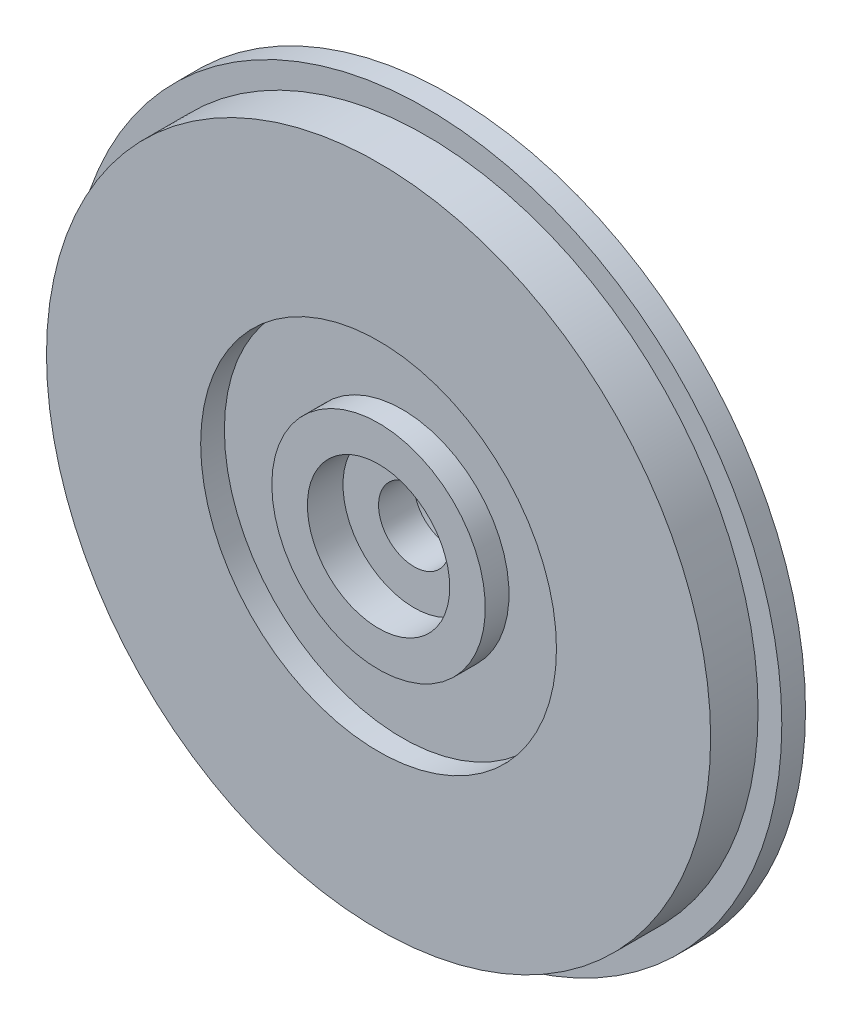
ISO-10303-21;
HEADER;
FILE_DESCRIPTION(('STEP AP214'),'2;1');
FILE_NAME('part.step','',(''),(''),'','','');
FILE_SCHEMA(('AUTOMOTIVE_DESIGN { 1 0 10303 214 1 1 1 1 }'));
ENDSEC;
DATA;
#1=APPLICATION_CONTEXT('core data for automotive mechanical design processes');
#2=APPLICATION_PROTOCOL_DEFINITION('international standard','automotive_design',2000,#1);
#3=PRODUCT_CONTEXT('',#1,'mechanical');
#4=PRODUCT('Part','Part','',(#3));
#5=PRODUCT_RELATED_PRODUCT_CATEGORY('part','',(#4));
#6=PRODUCT_DEFINITION_FORMATION('','',#4);
#7=PRODUCT_DEFINITION_CONTEXT('part definition',#1,'design');
#8=PRODUCT_DEFINITION('design','',#6,#7);
#9=PRODUCT_DEFINITION_SHAPE('','',#8);
#10=(LENGTH_UNIT() NAMED_UNIT(*) SI_UNIT(.MILLI.,.METRE.));
#11=(NAMED_UNIT(*) PLANE_ANGLE_UNIT() SI_UNIT($,.RADIAN.));
#12=(NAMED_UNIT(*) SI_UNIT($,.STERADIAN.) SOLID_ANGLE_UNIT());
#13=UNCERTAINTY_MEASURE_WITH_UNIT(LENGTH_MEASURE(1.E-05),#10,'distance_accuracy_value','');
#14=(GEOMETRIC_REPRESENTATION_CONTEXT(3) GLOBAL_UNCERTAINTY_ASSIGNED_CONTEXT((#13)) GLOBAL_UNIT_ASSIGNED_CONTEXT((#10,
#11,#12)) REPRESENTATION_CONTEXT('',''));
#15=CARTESIAN_POINT('',(0.,0.,0.));
#16=DIRECTION('',(0.,0.,1.));
#17=DIRECTION('',(1.,0.,0.));
#18=AXIS2_PLACEMENT_3D('',#15,#16,#17);
#19=CARTESIAN_POINT('',(15.,0.,-2.));
#20=DIRECTION('',(0.,0.,1.));
#21=DIRECTION('',(1.,0.,0.));
#22=AXIS2_PLACEMENT_3D('',#19,#20,#21);
#23=PLANE('',#22);
#24=CARTESIAN_POINT('',(0.,0.,-2.00000000000001));
#25=DIRECTION('',(0.,0.,1.));
#26=DIRECTION('',(1.,0.,0.));
#27=AXIS2_PLACEMENT_3D('',#24,#25,#26);
#28=CIRCLE('',#27,1.5);
#29=CARTESIAN_POINT('',(1.5,0.,-2.00000000000001));
#30=VERTEX_POINT('',#29);
#31=EDGE_CURVE('E92',#30,#30,#28,.T.);
#32=ORIENTED_EDGE('',*,*,#31,.T.);
#33=EDGE_LOOP('',(#32));
#34=FACE_BOUND('',#33,.T.);
#35=CARTESIAN_POINT('',(0.,0.,-2.));
#36=DIRECTION('',(0.,0.,-1.));
#37=DIRECTION('',(-1.,0.,0.));
#38=AXIS2_PLACEMENT_3D('',#35,#36,#37);
#39=CIRCLE('',#38,4.);
#40=CARTESIAN_POINT('',(-4.,0.,-2.));
#41=VERTEX_POINT('',#40);
#42=EDGE_CURVE('E108',#41,#41,#39,.T.);
#43=ORIENTED_EDGE('',*,*,#42,.T.);
#44=EDGE_LOOP('',(#43));
#45=FACE_BOUND('',#44,.T.);
#46=ADVANCED_FACE('F43',(#34,#45),#23,.F.);
#47=CARTESIAN_POINT('',(0.,0.,1.));
#48=DIRECTION('',(0.,0.,-1.));
#49=DIRECTION('',(-1.,0.,0.));
#50=AXIS2_PLACEMENT_3D('',#47,#48,#49);
#51=PLANE('',#50);
#52=CARTESIAN_POINT('',(0.,0.,1.));
#53=DIRECTION('',(0.,0.,1.));
#54=DIRECTION('',(1.,0.,0.));
#55=AXIS2_PLACEMENT_3D('',#52,#53,#54);
#56=CIRCLE('',#55,3.);
#57=CARTESIAN_POINT('',(3.,0.,1.));
#58=VERTEX_POINT('',#57);
#59=EDGE_CURVE('E88',#58,#58,#56,.T.);
#60=ORIENTED_EDGE('',*,*,#59,.F.);
#61=EDGE_LOOP('',(#60));
#62=FACE_BOUND('',#61,.T.);
#63=CARTESIAN_POINT('',(0.,0.,1.));
#64=DIRECTION('',(0.,0.,-1.));
#65=DIRECTION('',(-1.,0.,0.));
#66=AXIS2_PLACEMENT_3D('',#63,#64,#65);
#67=CIRCLE('',#66,4.5);
#68=CARTESIAN_POINT('',(-4.5,0.,0.999999999999999));
#69=VERTEX_POINT('',#68);
#70=EDGE_CURVE('E51',#69,#69,#67,.T.);
#71=ORIENTED_EDGE('',*,*,#70,.F.);
#72=EDGE_LOOP('',(#71));
#73=FACE_BOUND('',#72,.T.);
#74=ADVANCED_FACE('F45',(#62,#73),#51,.F.);
#75=CARTESIAN_POINT('',(0.,0.,-2.));
#76=DIRECTION('',(0.,0.,-1.));
#77=DIRECTION('',(-1.,0.,0.));
#78=AXIS2_PLACEMENT_3D('',#75,#76,#77);
#79=CYLINDRICAL_SURFACE('',#78,4.5);
#80=CARTESIAN_POINT('',(0.,0.,0.));
#81=DIRECTION('',(0.,0.,-1.));
#82=DIRECTION('',(-1.,0.,0.));
#83=AXIS2_PLACEMENT_3D('',#80,#81,#82);
#84=CIRCLE('',#83,4.5);
#85=CARTESIAN_POINT('',(-4.5,0.,0.));
#86=VERTEX_POINT('',#85);
#87=EDGE_CURVE('E56',#86,#86,#84,.T.);
#88=ORIENTED_EDGE('',*,*,#87,.F.);
#89=EDGE_LOOP('',(#88));
#90=FACE_BOUND('',#89,.T.);
#91=ORIENTED_EDGE('',*,*,#70,.T.);
#92=EDGE_LOOP('',(#91));
#93=FACE_BOUND('',#92,.T.);
#94=ADVANCED_FACE('F145',(#90,#93),#79,.T.);
#95=CARTESIAN_POINT('',(4.5,0.,0.));
#96=DIRECTION('',(0.,0.,-1.));
#97=DIRECTION('',(-1.,0.,0.));
#98=AXIS2_PLACEMENT_3D('',#95,#96,#97);
#99=PLANE('',#98);
#100=CARTESIAN_POINT('',(0.,0.,0.));
#101=DIRECTION('',(0.,0.,-1.));
#102=DIRECTION('',(-1.,0.,0.));
#103=AXIS2_PLACEMENT_3D('',#100,#101,#102);
#104=CIRCLE('',#103,7.5);
#105=CARTESIAN_POINT('',(-7.5,0.,0.));
#106=VERTEX_POINT('',#105);
#107=EDGE_CURVE('E61',#106,#106,#104,.T.);
#108=ORIENTED_EDGE('',*,*,#107,.F.);
#109=EDGE_LOOP('',(#108));
#110=FACE_BOUND('',#109,.T.);
#111=ORIENTED_EDGE('',*,*,#87,.T.);
#112=EDGE_LOOP('',(#111));
#113=FACE_BOUND('',#112,.T.);
#114=ADVANCED_FACE('F185',(#110,#113),#99,.F.);
#115=CARTESIAN_POINT('',(0.,0.,-2.));
#116=DIRECTION('',(0.,0.,-1.));
#117=DIRECTION('',(-1.,0.,0.));
#118=AXIS2_PLACEMENT_3D('',#115,#116,#117);
#119=CYLINDRICAL_SURFACE('',#118,7.5);
#120=CARTESIAN_POINT('',(0.,0.,0.999999999999999));
#121=DIRECTION('',(0.,0.,-1.));
#122=DIRECTION('',(-1.,0.,0.));
#123=AXIS2_PLACEMENT_3D('',#120,#121,#122);
#124=CIRCLE('',#123,7.5);
#125=CARTESIAN_POINT('',(-7.5,0.,0.999999999999998));
#126=VERTEX_POINT('',#125);
#127=EDGE_CURVE('E67',#126,#126,#124,.T.);
#128=ORIENTED_EDGE('',*,*,#127,.F.);
#129=EDGE_LOOP('',(#128));
#130=FACE_BOUND('',#129,.T.);
#131=ORIENTED_EDGE('',*,*,#107,.T.);
#132=EDGE_LOOP('',(#131));
#133=FACE_BOUND('',#132,.T.);
#134=ADVANCED_FACE('F179',(#130,#133),#119,.F.);
#135=CARTESIAN_POINT('',(7.5,0.,1.));
#136=DIRECTION('',(0.,0.,-1.));
#137=DIRECTION('',(-1.,0.,0.));
#138=AXIS2_PLACEMENT_3D('',#135,#136,#137);
#139=PLANE('',#138);
#140=CARTESIAN_POINT('',(0.,0.,0.999999999999998));
#141=DIRECTION('',(0.,0.,-1.));
#142=DIRECTION('',(-1.,0.,0.));
#143=AXIS2_PLACEMENT_3D('',#140,#141,#142);
#144=CIRCLE('',#143,14.);
#145=CARTESIAN_POINT('',(-14.,0.,0.999999999999996));
#146=VERTEX_POINT('',#145);
#147=EDGE_CURVE('E71',#146,#146,#144,.T.);
#148=ORIENTED_EDGE('',*,*,#147,.F.);
#149=EDGE_LOOP('',(#148));
#150=FACE_BOUND('',#149,.T.);
#151=ORIENTED_EDGE('',*,*,#127,.T.);
#152=EDGE_LOOP('',(#151));
#153=FACE_BOUND('',#152,.T.);
#154=ADVANCED_FACE('F173',(#150,#153),#139,.F.);
#155=CARTESIAN_POINT('',(0.,0.,-2.));
#156=DIRECTION('',(0.,0.,-1.));
#157=DIRECTION('',(-1.,0.,0.));
#158=AXIS2_PLACEMENT_3D('',#155,#156,#157);
#159=CYLINDRICAL_SURFACE('',#158,14.);
#160=CARTESIAN_POINT('',(0.,0.,-1.));
#161=DIRECTION('',(0.,0.,-1.));
#162=DIRECTION('',(-1.,0.,0.));
#163=AXIS2_PLACEMENT_3D('',#160,#161,#162);
#164=CIRCLE('',#163,14.);
#165=CARTESIAN_POINT('',(-14.,0.,-1.00000000000001));
#166=VERTEX_POINT('',#165);
#167=EDGE_CURVE('E75',#166,#166,#164,.T.);
#168=ORIENTED_EDGE('',*,*,#167,.F.);
#169=EDGE_LOOP('',(#168));
#170=FACE_BOUND('',#169,.T.);
#171=ORIENTED_EDGE('',*,*,#147,.T.);
#172=EDGE_LOOP('',(#171));
#173=FACE_BOUND('',#172,.T.);
#174=ADVANCED_FACE('F167',(#170,#173),#159,.T.);
#175=CARTESIAN_POINT('',(14.,0.,-1.));
#176=DIRECTION('',(0.,0.,-1.));
#177=DIRECTION('',(-1.,0.,0.));
#178=AXIS2_PLACEMENT_3D('',#175,#176,#177);
#179=PLANE('',#178);
#180=CARTESIAN_POINT('',(0.,0.,-1.));
#181=DIRECTION('',(0.,0.,-1.));
#182=DIRECTION('',(-1.,0.,0.));
#183=AXIS2_PLACEMENT_3D('',#180,#181,#182);
#184=CIRCLE('',#183,15.);
#185=CARTESIAN_POINT('',(-15.,0.,-1.00000000000001));
#186=VERTEX_POINT('',#185);
#187=EDGE_CURVE('E79',#186,#186,#184,.T.);
#188=ORIENTED_EDGE('',*,*,#187,.F.);
#189=EDGE_LOOP('',(#188));
#190=FACE_BOUND('',#189,.T.);
#191=ORIENTED_EDGE('',*,*,#167,.T.);
#192=EDGE_LOOP('',(#191));
#193=FACE_BOUND('',#192,.T.);
#194=ADVANCED_FACE('F158',(#190,#193),#179,.F.);
#195=CARTESIAN_POINT('',(0.,0.,-2.));
#196=DIRECTION('',(0.,0.,-1.));
#197=DIRECTION('',(-1.,0.,0.));
#198=AXIS2_PLACEMENT_3D('',#195,#196,#197);
#199=CYLINDRICAL_SURFACE('',#198,15.);
#200=CARTESIAN_POINT('',(0.,0.,-2.));
#201=DIRECTION('',(0.,0.,-1.));
#202=DIRECTION('',(-1.,0.,0.));
#203=AXIS2_PLACEMENT_3D('',#200,#201,#202);
#204=CIRCLE('',#203,15.);
#205=CARTESIAN_POINT('',(-15.,0.,-2.00000000000001));
#206=VERTEX_POINT('',#205);
#207=EDGE_CURVE('E83',#206,#206,#204,.T.);
#208=ORIENTED_EDGE('',*,*,#207,.F.);
#209=EDGE_LOOP('',(#208));
#210=FACE_BOUND('',#209,.T.);
#211=ORIENTED_EDGE('',*,*,#187,.T.);
#212=EDGE_LOOP('',(#211));
#213=FACE_BOUND('',#212,.T.);
#214=ADVANCED_FACE('F151',(#210,#213),#199,.T.);
#215=CARTESIAN_POINT('',(0.,0.,-2.));
#216=DIRECTION('',(0.,0.,1.));
#217=DIRECTION('',(1.,0.,0.));
#218=AXIS2_PLACEMENT_3D('',#215,#216,#217);
#219=CIRCLE('',#218,5.);
#220=CARTESIAN_POINT('',(5.,0.,-2.));
#221=VERTEX_POINT('',#220);
#222=EDGE_CURVE('E11',#221,#221,#219,.F.);
#223=ORIENTED_EDGE('',*,*,#222,.F.);
#224=EDGE_LOOP('',(#223));
#225=FACE_BOUND('',#224,.T.);
#226=ORIENTED_EDGE('',*,*,#207,.T.);
#227=EDGE_LOOP('',(#226));
#228=FACE_BOUND('',#227,.T.);
#229=ADVANCED_FACE('F139',(#225,#228),#23,.F.);
#230=CARTESIAN_POINT('',(0.,0.,-0.5));
#231=DIRECTION('',(0.,0.,1.));
#232=DIRECTION('',(1.,0.,0.));
#233=AXIS2_PLACEMENT_3D('',#230,#231,#232);
#234=CYLINDRICAL_SURFACE('',#233,3.);
#235=CARTESIAN_POINT('',(0.,0.,-0.5));
#236=DIRECTION('',(0.,0.,1.));
#237=DIRECTION('',(1.,0.,0.));
#238=AXIS2_PLACEMENT_3D('',#235,#236,#237);
#239=CIRCLE('',#238,3.);
#240=CARTESIAN_POINT('',(3.,0.,-0.5));
#241=VERTEX_POINT('',#240);
#242=EDGE_CURVE('E87',#241,#241,#239,.T.);
#243=ORIENTED_EDGE('',*,*,#242,.F.);
#244=EDGE_LOOP('',(#243));
#245=FACE_BOUND('',#244,.T.);
#246=ORIENTED_EDGE('',*,*,#59,.T.);
#247=EDGE_LOOP('',(#246));
#248=FACE_BOUND('',#247,.T.);
#249=ADVANCED_FACE('F150',(#245,#248),#234,.F.);
#250=CARTESIAN_POINT('',(0.,0.,-0.5));
#251=DIRECTION('',(0.,0.,1.));
#252=DIRECTION('',(1.,0.,0.));
#253=AXIS2_PLACEMENT_3D('',#250,#251,#252);
#254=PLANE('',#253);
#255=CARTESIAN_POINT('',(0.,0.,-0.5));
#256=DIRECTION('',(0.,0.,1.));
#257=DIRECTION('',(1.,0.,0.));
#258=AXIS2_PLACEMENT_3D('',#255,#256,#257);
#259=CIRCLE('',#258,1.5);
#260=CARTESIAN_POINT('',(1.5,0.,-0.5));
#261=VERTEX_POINT('',#260);
#262=EDGE_CURVE('E96',#261,#261,#259,.T.);
#263=ORIENTED_EDGE('',*,*,#262,.F.);
#264=EDGE_LOOP('',(#263));
#265=FACE_BOUND('',#264,.T.);
#266=ORIENTED_EDGE('',*,*,#242,.T.);
#267=EDGE_LOOP('',(#266));
#268=FACE_BOUND('',#267,.T.);
#269=ADVANCED_FACE('F132',(#265,#268),#254,.T.);
#270=CARTESIAN_POINT('',(0.,0.,-2.00000000000001));
#271=DIRECTION('',(0.,0.,1.));
#272=DIRECTION('',(1.,0.,0.));
#273=AXIS2_PLACEMENT_3D('',#270,#271,#272);
#274=CYLINDRICAL_SURFACE('',#273,1.5);
#275=ORIENTED_EDGE('',*,*,#31,.F.);
#276=EDGE_LOOP('',(#275));
#277=FACE_BOUND('',#276,.T.);
#278=ORIENTED_EDGE('',*,*,#262,.T.);
#279=EDGE_LOOP('',(#278));
#280=FACE_BOUND('',#279,.T.);
#281=ADVANCED_FACE('F122',(#277,#280),#274,.F.);
#282=CARTESIAN_POINT('',(0.,0.,-4.));
#283=DIRECTION('',(0.,0.,-1.));
#284=DIRECTION('',(-1.,0.,0.));
#285=AXIS2_PLACEMENT_3D('',#282,#283,#284);
#286=PLANE('',#285);
#287=CARTESIAN_POINT('',(0.,0.,-4.));
#288=DIRECTION('',(0.,0.,-1.));
#289=DIRECTION('',(-1.,0.,0.));
#290=AXIS2_PLACEMENT_3D('',#287,#288,#289);
#291=CIRCLE('',#290,5.);
#292=CARTESIAN_POINT('',(-5.,0.,-4.));
#293=VERTEX_POINT('',#292);
#294=EDGE_CURVE('E100',#293,#293,#291,.T.);
#295=ORIENTED_EDGE('',*,*,#294,.T.);
#296=EDGE_LOOP('',(#295));
#297=FACE_BOUND('',#296,.T.);
#298=CARTESIAN_POINT('',(0.,0.,-4.));
#299=DIRECTION('',(0.,0.,-1.));
#300=DIRECTION('',(-1.,0.,0.));
#301=AXIS2_PLACEMENT_3D('',#298,#299,#300);
#302=CIRCLE('',#301,4.);
#303=CARTESIAN_POINT('',(-4.,0.,-4.));
#304=VERTEX_POINT('',#303);
#305=EDGE_CURVE('E107',#304,#304,#302,.T.);
#306=ORIENTED_EDGE('',*,*,#305,.F.);
#307=EDGE_LOOP('',(#306));
#308=FACE_BOUND('',#307,.T.);
#309=ADVANCED_FACE('F119',(#297,#308),#286,.T.);
#310=CARTESIAN_POINT('',(0.,0.,-4.));
#311=DIRECTION('',(0.,0.,1.));
#312=DIRECTION('',(1.,0.,0.));
#313=AXIS2_PLACEMENT_3D('',#310,#311,#312);
#314=CYLINDRICAL_SURFACE('',#313,5.);
#315=ORIENTED_EDGE('',*,*,#294,.F.);
#316=EDGE_LOOP('',(#315));
#317=FACE_BOUND('',#316,.T.);
#318=ORIENTED_EDGE('',*,*,#222,.T.);
#319=EDGE_LOOP('',(#318));
#320=FACE_BOUND('',#319,.T.);
#321=ADVANCED_FACE('F121',(#317,#320),#314,.T.);
#322=CARTESIAN_POINT('',(0.,0.,-4.));
#323=DIRECTION('',(0.,0.,1.));
#324=DIRECTION('',(1.,0.,0.));
#325=AXIS2_PLACEMENT_3D('',#322,#323,#324);
#326=CYLINDRICAL_SURFACE('',#325,4.);
#327=ORIENTED_EDGE('',*,*,#305,.T.);
#328=EDGE_LOOP('',(#327));
#329=FACE_BOUND('',#328,.T.);
#330=ORIENTED_EDGE('',*,*,#42,.F.);
#331=EDGE_LOOP('',(#330));
#332=FACE_BOUND('',#331,.T.);
#333=ADVANCED_FACE('F116',(#329,#332),#326,.F.);
#334=CLOSED_SHELL('',(#46,#74,#94,#114,#134,#154,#174,#194,#214,#229,#249,#269,#281,#309,#321,#333));
#335=MANIFOLD_SOLID_BREP('B2',#334);
#336=ADVANCED_BREP_SHAPE_REPRESENTATION('',(#18,#335),#14);
#337=SHAPE_DEFINITION_REPRESENTATION(#9,#336);
ENDSEC;
END-ISO-10303-21;
